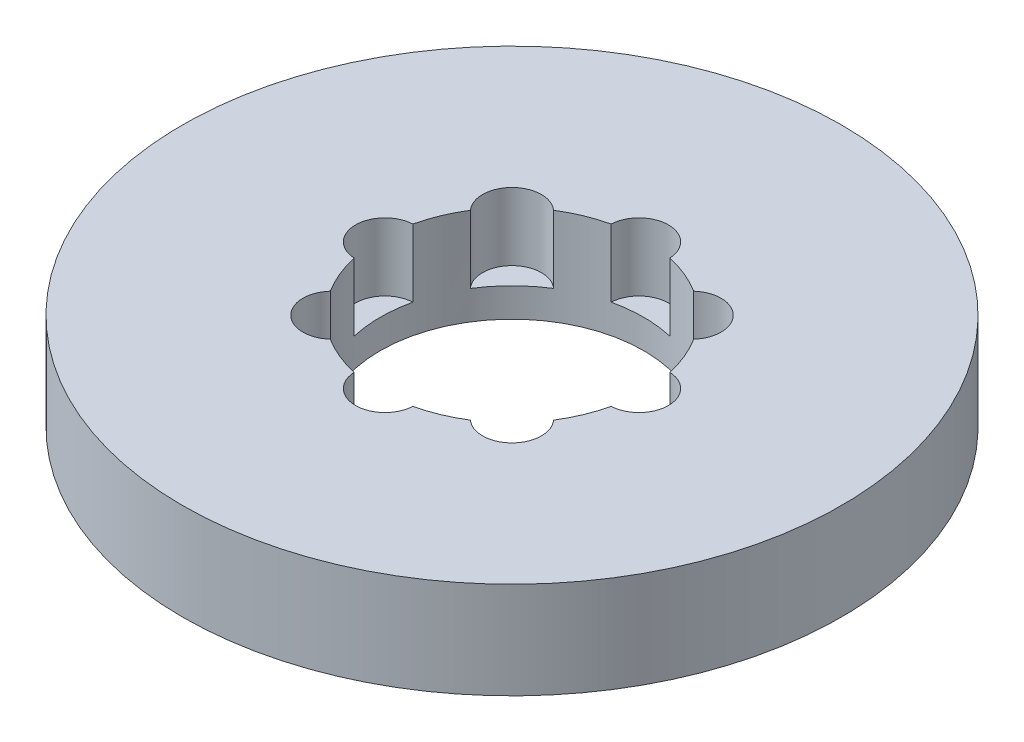
ISO-10303-21;
HEADER;
FILE_DESCRIPTION(('STEP AP214'),'2;1');
FILE_NAME('part.step','',(''),(''),'','','');
FILE_SCHEMA(('AUTOMOTIVE_DESIGN { 1 0 10303 214 1 1 1 1 }'));
ENDSEC;
DATA;
#1=APPLICATION_CONTEXT('core data for automotive mechanical design processes');
#2=APPLICATION_PROTOCOL_DEFINITION('international standard','automotive_design',2000,#1);
#3=PRODUCT_CONTEXT('',#1,'mechanical');
#4=PRODUCT('Part','Part','',(#3));
#5=PRODUCT_RELATED_PRODUCT_CATEGORY('part','',(#4));
#6=PRODUCT_DEFINITION_FORMATION('','',#4);
#7=PRODUCT_DEFINITION_CONTEXT('part definition',#1,'design');
#8=PRODUCT_DEFINITION('design','',#6,#7);
#9=PRODUCT_DEFINITION_SHAPE('','',#8);
#10=(LENGTH_UNIT() NAMED_UNIT(*) SI_UNIT(.MILLI.,.METRE.));
#11=(NAMED_UNIT(*) PLANE_ANGLE_UNIT() SI_UNIT($,.RADIAN.));
#12=(NAMED_UNIT(*) SI_UNIT($,.STERADIAN.) SOLID_ANGLE_UNIT());
#13=UNCERTAINTY_MEASURE_WITH_UNIT(LENGTH_MEASURE(1.E-05),#10,'distance_accuracy_value','');
#14=(GEOMETRIC_REPRESENTATION_CONTEXT(3) GLOBAL_UNCERTAINTY_ASSIGNED_CONTEXT((#13)) GLOBAL_UNIT_ASSIGNED_CONTEXT((#10,
#11,#12)) REPRESENTATION_CONTEXT('',''));
#15=CARTESIAN_POINT('',(0.,0.,0.));
#16=DIRECTION('',(0.,0.,1.));
#17=DIRECTION('',(1.,0.,0.));
#18=AXIS2_PLACEMENT_3D('',#15,#16,#17);
#19=CARTESIAN_POINT('',(0.,11.,0.));
#20=DIRECTION('',(0.,-1.,0.));
#21=DIRECTION('',(0.,0.,-1.));
#22=AXIS2_PLACEMENT_3D('',#19,#20,#21);
#23=CYLINDRICAL_SURFACE('',#22,37.5);
#24=CARTESIAN_POINT('',(0.,11.,0.));
#25=DIRECTION('',(0.,1.,0.));
#26=DIRECTION('',(0.,0.,1.));
#27=AXIS2_PLACEMENT_3D('',#24,#25,#26);
#28=CIRCLE('',#27,37.5);
#29=CARTESIAN_POINT('',(0.,11.,37.5));
#30=VERTEX_POINT('',#29);
#31=EDGE_CURVE('E183',#30,#30,#28,.T.);
#32=ORIENTED_EDGE('',*,*,#31,.F.);
#33=EDGE_LOOP('',(#32));
#34=FACE_BOUND('',#33,.T.);
#35=CARTESIAN_POINT('',(0.,0.,0.));
#36=DIRECTION('',(0.,1.,0.));
#37=DIRECTION('',(0.,0.,1.));
#38=AXIS2_PLACEMENT_3D('',#35,#36,#37);
#39=CIRCLE('',#38,37.5);
#40=CARTESIAN_POINT('',(0.,0.,37.5));
#41=VERTEX_POINT('',#40);
#42=EDGE_CURVE('E182',#41,#41,#39,.T.);
#43=ORIENTED_EDGE('',*,*,#42,.T.);
#44=EDGE_LOOP('',(#43));
#45=FACE_BOUND('',#44,.T.);
#46=ADVANCED_FACE('F39',(#34,#45),#23,.T.);
#47=CARTESIAN_POINT('',(0.,11.,0.));
#48=DIRECTION('',(0.,1.,0.));
#49=DIRECTION('',(0.,0.,1.));
#50=AXIS2_PLACEMENT_3D('',#47,#48,#49);
#51=PLANE('',#50);
#52=CARTESIAN_POINT('',(0.,11.,14.4545769503984));
#53=DIRECTION('',(0.,1.,0.));
#54=DIRECTION('',(1.,0.,0.));
#55=AXIS2_PLACEMENT_3D('',#52,#53,#54);
#56=CIRCLE('',#55,3.34973262926562);
#57=CARTESIAN_POINT('',(-3.34553834006836,11.,14.6221535081236));
#58=VERTEX_POINT('',#57);
#59=CARTESIAN_POINT('',(3.34553834006846,11.,14.6221535081236));
#60=VERTEX_POINT('',#59);
#61=EDGE_CURVE('E256',#58,#60,#56,.T.);
#62=ORIENTED_EDGE('',*,*,#61,.F.);
#63=CARTESIAN_POINT('',(0.,11.,0.));
#64=DIRECTION('',(0.,1.,0.));
#65=DIRECTION('',(0.,0.,1.));
#66=AXIS2_PLACEMENT_3D('',#63,#64,#65);
#67=CIRCLE('',#66,15.);
#68=CARTESIAN_POINT('',(-7.9737710541629,11.,12.7050767481269));
#69=VERTEX_POINT('',#68);
#70=EDGE_CURVE('E175',#69,#58,#67,.T.);
#71=ORIENTED_EDGE('',*,*,#70,.F.);
#72=CARTESIAN_POINT('',(-10.2209293808095,11.,10.2209293808095));
#73=DIRECTION('',(0.,1.,0.));
#74=DIRECTION('',(0.707106781186549,0.,0.707106781186546));
#75=AXIS2_PLACEMENT_3D('',#72,#73,#74);
#76=CIRCLE('',#75,3.34973262926562);
#77=CARTESIAN_POINT('',(-12.7050767481268,11.,7.97377105416295));
#78=VERTEX_POINT('',#77);
#79=EDGE_CURVE('E152',#78,#69,#76,.T.);
#80=ORIENTED_EDGE('',*,*,#79,.F.);
#81=CARTESIAN_POINT('',(-14.6221535081236,11.,3.34553834006841));
#82=VERTEX_POINT('',#81);
#83=EDGE_CURVE('E168',#82,#78,#67,.T.);
#84=ORIENTED_EDGE('',*,*,#83,.F.);
#85=CARTESIAN_POINT('',(-14.4545769503984,11.,0.));
#86=DIRECTION('',(0.,1.,0.));
#87=DIRECTION('',(0.,0.,1.));
#88=AXIS2_PLACEMENT_3D('',#85,#86,#87);
#89=CIRCLE('',#88,3.34973262926562);
#90=CARTESIAN_POINT('',(-14.6221535081236,11.,-3.34553834006841));
#91=VERTEX_POINT('',#90);
#92=EDGE_CURVE('E205',#91,#82,#89,.T.);
#93=ORIENTED_EDGE('',*,*,#92,.F.);
#94=CARTESIAN_POINT('',(-12.7050767481269,11.,-7.97377105416277));
#95=VERTEX_POINT('',#94);
#96=EDGE_CURVE('E181',#95,#91,#67,.T.);
#97=ORIENTED_EDGE('',*,*,#96,.F.);
#98=CARTESIAN_POINT('',(-10.2209293808096,11.,-10.2209293808094));
#99=DIRECTION('',(0.,1.,0.));
#100=DIRECTION('',(-0.707106781186539,0.,0.707106781186556));
#101=AXIS2_PLACEMENT_3D('',#98,#99,#100);
#102=CIRCLE('',#101,3.34973262926562);
#103=CARTESIAN_POINT('',(-7.97377105416308,11.,-12.7050767481267));
#104=VERTEX_POINT('',#103);
#105=EDGE_CURVE('E453',#104,#95,#102,.T.);
#106=ORIENTED_EDGE('',*,*,#105,.F.);
#107=CARTESIAN_POINT('',(-3.34553834006857,11.,-14.6221535081236));
#108=VERTEX_POINT('',#107);
#109=EDGE_CURVE('E189',#108,#104,#67,.T.);
#110=ORIENTED_EDGE('',*,*,#109,.F.);
#111=CARTESIAN_POINT('',(-1.51403657049564E-13,11.,-14.4545769503984));
#112=DIRECTION('',(0.,1.,0.));
#113=DIRECTION('',(-1.,0.,0.));
#114=AXIS2_PLACEMENT_3D('',#111,#112,#113);
#115=CIRCLE('',#114,3.34973262926562);
#116=CARTESIAN_POINT('',(3.34553834006826,11.,-14.6221535081237));
#117=VERTEX_POINT('',#116);
#118=EDGE_CURVE('E462',#117,#108,#115,.T.);
#119=ORIENTED_EDGE('',*,*,#118,.F.);
#120=CARTESIAN_POINT('',(7.97377105416282,11.,-12.7050767481269));
#121=VERTEX_POINT('',#120);
#122=EDGE_CURVE('E197',#121,#117,#67,.T.);
#123=ORIENTED_EDGE('',*,*,#122,.F.);
#124=CARTESIAN_POINT('',(10.2209293808094,11.,-10.2209293808096));
#125=DIRECTION('',(0.,1.,0.));
#126=DIRECTION('',(-0.707106781186554,0.,-0.707106781186541));
#127=AXIS2_PLACEMENT_3D('',#124,#125,#126);
#128=CIRCLE('',#127,3.34973262926562);
#129=CARTESIAN_POINT('',(12.7050767481268,11.,-7.97377105416304));
#130=VERTEX_POINT('',#129);
#131=EDGE_CURVE('E470',#130,#121,#128,.T.);
#132=ORIENTED_EDGE('',*,*,#131,.F.);
#133=CARTESIAN_POINT('',(14.6221535081236,11.,-3.34553834006841));
#134=VERTEX_POINT('',#133);
#135=EDGE_CURVE('E489',#134,#130,#67,.T.);
#136=ORIENTED_EDGE('',*,*,#135,.F.);
#137=CARTESIAN_POINT('',(14.4545769503984,11.,0.));
#138=DIRECTION('',(0.,1.,0.));
#139=DIRECTION('',(0.,0.,-1.));
#140=AXIS2_PLACEMENT_3D('',#137,#138,#139);
#141=CIRCLE('',#140,3.34973262926562);
#142=CARTESIAN_POINT('',(14.6221535081236,11.,3.34553834006841));
#143=VERTEX_POINT('',#142);
#144=EDGE_CURVE('E476',#143,#134,#141,.T.);
#145=ORIENTED_EDGE('',*,*,#144,.F.);
#146=CARTESIAN_POINT('',(12.7050767481269,11.,7.97377105416286));
#147=VERTEX_POINT('',#146);
#148=EDGE_CURVE('E491',#147,#143,#67,.T.);
#149=ORIENTED_EDGE('',*,*,#148,.F.);
#150=CARTESIAN_POINT('',(10.2209293808095,11.,10.2209293808094));
#151=DIRECTION('',(0.,1.,0.));
#152=DIRECTION('',(0.707106781186544,0.,-0.707106781186551));
#153=AXIS2_PLACEMENT_3D('',#150,#151,#152);
#154=CIRCLE('',#153,3.34973262926562);
#155=CARTESIAN_POINT('',(7.97377105416299,11.,12.7050767481268));
#156=VERTEX_POINT('',#155);
#157=EDGE_CURVE('E475',#156,#147,#154,.T.);
#158=ORIENTED_EDGE('',*,*,#157,.F.);
#159=EDGE_CURVE('E190',#60,#156,#67,.T.);
#160=ORIENTED_EDGE('',*,*,#159,.F.);
#161=EDGE_LOOP('',(#62,#71,#80,#84,#93,#97,#106,#110,#119,#123,#132,#136,#145,#149,#158,#160));
#162=FACE_BOUND('',#161,.T.);
#163=ORIENTED_EDGE('',*,*,#31,.T.);
#164=EDGE_LOOP('',(#163));
#165=FACE_BOUND('',#164,.T.);
#166=ADVANCED_FACE('F170',(#162,#165),#51,.T.);
#167=CARTESIAN_POINT('',(0.,0.,0.));
#168=DIRECTION('',(0.,1.,0.));
#169=DIRECTION('',(0.,0.,1.));
#170=AXIS2_PLACEMENT_3D('',#167,#168,#169);
#171=PLANE('',#170);
#172=CARTESIAN_POINT('',(0.,0.,0.));
#173=DIRECTION('',(0.,1.,0.));
#174=DIRECTION('',(0.,0.,1.));
#175=AXIS2_PLACEMENT_3D('',#172,#173,#174);
#176=CIRCLE('',#175,15.);
#177=CARTESIAN_POINT('',(0.,0.,15.));
#178=VERTEX_POINT('',#177);
#179=EDGE_CURVE('E191',#178,#178,#176,.T.);
#180=ORIENTED_EDGE('',*,*,#179,.T.);
#181=EDGE_LOOP('',(#180));
#182=FACE_BOUND('',#181,.T.);
#183=ORIENTED_EDGE('',*,*,#42,.F.);
#184=EDGE_LOOP('',(#183));
#185=FACE_BOUND('',#184,.T.);
#186=ADVANCED_FACE('F277',(#182,#185),#171,.F.);
#187=CARTESIAN_POINT('',(0.,11.,0.));
#188=DIRECTION('',(0.,-1.,0.));
#189=DIRECTION('',(0.,0.,-1.));
#190=AXIS2_PLACEMENT_3D('',#187,#188,#189);
#191=CYLINDRICAL_SURFACE('',#190,15.);
#192=DIRECTION('',(0.,1.,0.));
#193=VECTOR('',#192,1.);
#194=CARTESIAN_POINT('',(-3.34553834006836,7.14872177654088,14.6221535081236));
#195=LINE('',#194,#193);
#196=CARTESIAN_POINT('',(-3.34553834006836,3.29744355308177,14.6221535081236));
#197=VERTEX_POINT('',#196);
#198=EDGE_CURVE('E11',#197,#58,#195,.T.);
#199=ORIENTED_EDGE('',*,*,#198,.F.);
#200=CARTESIAN_POINT('',(0.,3.29744355308177,0.));
#201=DIRECTION('',(0.,1.,0.));
#202=DIRECTION('',(0.,0.,1.));
#203=AXIS2_PLACEMENT_3D('',#200,#201,#202);
#204=CIRCLE('',#203,15.);
#205=CARTESIAN_POINT('',(3.34553834006846,3.29744355308177,14.6221535081236));
#206=VERTEX_POINT('',#205);
#207=EDGE_CURVE('E251',#197,#206,#204,.T.);
#208=ORIENTED_EDGE('',*,*,#207,.T.);
#209=DIRECTION('',(0.,1.,0.));
#210=VECTOR('',#209,1.);
#211=CARTESIAN_POINT('',(3.34553834006846,7.14872177654088,14.6221535081236));
#212=LINE('',#211,#210);
#213=EDGE_CURVE('E46',#60,#206,#212,.F.);
#214=ORIENTED_EDGE('',*,*,#213,.F.);
#215=ORIENTED_EDGE('',*,*,#159,.T.);
#216=DIRECTION('',(0.,1.,0.));
#217=VECTOR('',#216,1.);
#218=CARTESIAN_POINT('',(7.97377105416299,7.14872177654088,12.7050767481268));
#219=LINE('',#218,#217);
#220=CARTESIAN_POINT('',(7.97377105416299,3.29744355308177,12.7050767481268));
#221=VERTEX_POINT('',#220);
#222=EDGE_CURVE('E253',#221,#156,#219,.T.);
#223=ORIENTED_EDGE('',*,*,#222,.F.);
#224=CARTESIAN_POINT('',(0.,3.29744355308177,0.));
#225=DIRECTION('',(0.,1.,0.));
#226=DIRECTION('',(0.,0.,1.));
#227=AXIS2_PLACEMENT_3D('',#224,#225,#226);
#228=CIRCLE('',#227,15.);
#229=CARTESIAN_POINT('',(12.7050767481269,3.29744355308177,7.97377105416286));
#230=VERTEX_POINT('',#229);
#231=EDGE_CURVE('E246',#221,#230,#228,.T.);
#232=ORIENTED_EDGE('',*,*,#231,.T.);
#233=DIRECTION('',(0.,1.,0.));
#234=VECTOR('',#233,1.);
#235=CARTESIAN_POINT('',(12.7050767481269,7.14872177654088,7.97377105416286));
#236=LINE('',#235,#234);
#237=EDGE_CURVE('E248',#147,#230,#236,.F.);
#238=ORIENTED_EDGE('',*,*,#237,.F.);
#239=ORIENTED_EDGE('',*,*,#148,.T.);
#240=DIRECTION('',(0.,1.,0.));
#241=VECTOR('',#240,1.);
#242=CARTESIAN_POINT('',(14.6221535081236,7.14872177654088,3.34553834006841));
#243=LINE('',#242,#241);
#244=CARTESIAN_POINT('',(14.6221535081236,3.29744355308177,3.34553834006841));
#245=VERTEX_POINT('',#244);
#246=EDGE_CURVE('E243',#245,#143,#243,.T.);
#247=ORIENTED_EDGE('',*,*,#246,.F.);
#248=CARTESIAN_POINT('',(0.,3.29744355308177,0.));
#249=DIRECTION('',(0.,1.,0.));
#250=DIRECTION('',(0.,0.,1.));
#251=AXIS2_PLACEMENT_3D('',#248,#249,#250);
#252=CIRCLE('',#251,15.);
#253=CARTESIAN_POINT('',(14.6221535081236,3.29744355308177,-3.34553834006841));
#254=VERTEX_POINT('',#253);
#255=EDGE_CURVE('E236',#245,#254,#252,.T.);
#256=ORIENTED_EDGE('',*,*,#255,.T.);
#257=DIRECTION('',(0.,1.,0.));
#258=VECTOR('',#257,1.);
#259=CARTESIAN_POINT('',(14.6221535081236,7.14872177654088,-3.34553834006841));
#260=LINE('',#259,#258);
#261=EDGE_CURVE('E241',#134,#254,#260,.F.);
#262=ORIENTED_EDGE('',*,*,#261,.F.);
#263=ORIENTED_EDGE('',*,*,#135,.T.);
#264=DIRECTION('',(0.,1.,0.));
#265=VECTOR('',#264,1.);
#266=CARTESIAN_POINT('',(12.7050767481268,7.14872177654088,-7.97377105416304));
#267=LINE('',#266,#265);
#268=CARTESIAN_POINT('',(12.7050767481268,3.29744355308177,-7.97377105416304));
#269=VERTEX_POINT('',#268);
#270=EDGE_CURVE('E237',#269,#130,#267,.T.);
#271=ORIENTED_EDGE('',*,*,#270,.F.);
#272=CARTESIAN_POINT('',(0.,3.29744355308177,0.));
#273=DIRECTION('',(0.,1.,0.));
#274=DIRECTION('',(0.,0.,1.));
#275=AXIS2_PLACEMENT_3D('',#272,#273,#274);
#276=CIRCLE('',#275,15.);
#277=CARTESIAN_POINT('',(7.97377105416282,3.29744355308177,-12.7050767481269));
#278=VERTEX_POINT('',#277);
#279=EDGE_CURVE('E229',#269,#278,#276,.T.);
#280=ORIENTED_EDGE('',*,*,#279,.T.);
#281=DIRECTION('',(0.,1.,0.));
#282=VECTOR('',#281,1.);
#283=CARTESIAN_POINT('',(7.97377105416281,7.14872177654088,-12.7050767481269));
#284=LINE('',#283,#282);
#285=EDGE_CURVE('E232',#121,#278,#284,.F.);
#286=ORIENTED_EDGE('',*,*,#285,.F.);
#287=ORIENTED_EDGE('',*,*,#122,.T.);
#288=DIRECTION('',(0.,1.,0.));
#289=VECTOR('',#288,1.);
#290=CARTESIAN_POINT('',(3.34553834006826,7.14872177654088,-14.6221535081237));
#291=LINE('',#290,#289);
#292=CARTESIAN_POINT('',(3.34553834006826,3.29744355308177,-14.6221535081237));
#293=VERTEX_POINT('',#292);
#294=EDGE_CURVE('E227',#293,#117,#291,.T.);
#295=ORIENTED_EDGE('',*,*,#294,.F.);
#296=CARTESIAN_POINT('',(0.,3.29744355308177,0.));
#297=DIRECTION('',(0.,1.,0.));
#298=DIRECTION('',(0.,0.,1.));
#299=AXIS2_PLACEMENT_3D('',#296,#297,#298);
#300=CIRCLE('',#299,15.);
#301=CARTESIAN_POINT('',(-3.34553834006857,3.29744355308177,-14.6221535081236));
#302=VERTEX_POINT('',#301);
#303=EDGE_CURVE('E225',#293,#302,#300,.T.);
#304=ORIENTED_EDGE('',*,*,#303,.T.);
#305=DIRECTION('',(0.,1.,0.));
#306=VECTOR('',#305,1.);
#307=CARTESIAN_POINT('',(-3.34553834006857,7.14872177654088,-14.6221535081236));
#308=LINE('',#307,#306);
#309=EDGE_CURVE('E223',#108,#302,#308,.F.);
#310=ORIENTED_EDGE('',*,*,#309,.F.);
#311=ORIENTED_EDGE('',*,*,#109,.T.);
#312=DIRECTION('',(0.,1.,0.));
#313=VECTOR('',#312,1.);
#314=CARTESIAN_POINT('',(-7.97377105416308,7.14872177654088,-12.7050767481267));
#315=LINE('',#314,#313);
#316=CARTESIAN_POINT('',(-7.97377105416308,3.29744355308177,-12.7050767481267));
#317=VERTEX_POINT('',#316);
#318=EDGE_CURVE('E219',#317,#104,#315,.T.);
#319=ORIENTED_EDGE('',*,*,#318,.F.);
#320=CARTESIAN_POINT('',(0.,3.29744355308177,0.));
#321=DIRECTION('',(0.,1.,0.));
#322=DIRECTION('',(0.,0.,1.));
#323=AXIS2_PLACEMENT_3D('',#320,#321,#322);
#324=CIRCLE('',#323,15.);
#325=CARTESIAN_POINT('',(-12.7050767481269,3.29744355308177,-7.97377105416277));
#326=VERTEX_POINT('',#325);
#327=EDGE_CURVE('E159',#317,#326,#324,.T.);
#328=ORIENTED_EDGE('',*,*,#327,.T.);
#329=DIRECTION('',(0.,1.,0.));
#330=VECTOR('',#329,1.);
#331=CARTESIAN_POINT('',(-12.7050767481269,7.14872177654088,-7.97377105416277));
#332=LINE('',#331,#330);
#333=EDGE_CURVE('E220',#95,#326,#332,.F.);
#334=ORIENTED_EDGE('',*,*,#333,.F.);
#335=ORIENTED_EDGE('',*,*,#96,.T.);
#336=DIRECTION('',(0.,1.,0.));
#337=VECTOR('',#336,1.);
#338=CARTESIAN_POINT('',(-14.6221535081236,7.14872177654088,-3.34553834006841));
#339=LINE('',#338,#337);
#340=CARTESIAN_POINT('',(-14.6221535081236,3.29744355308177,-3.34553834006841));
#341=VERTEX_POINT('',#340);
#342=EDGE_CURVE('E209',#341,#91,#339,.T.);
#343=ORIENTED_EDGE('',*,*,#342,.F.);
#344=CARTESIAN_POINT('',(0.,3.29744355308177,0.));
#345=DIRECTION('',(0.,1.,0.));
#346=DIRECTION('',(0.,0.,1.));
#347=AXIS2_PLACEMENT_3D('',#344,#345,#346);
#348=CIRCLE('',#347,15.);
#349=CARTESIAN_POINT('',(-14.6221535081236,3.29744355308177,3.34553834006841));
#350=VERTEX_POINT('',#349);
#351=EDGE_CURVE('E206',#341,#350,#348,.T.);
#352=ORIENTED_EDGE('',*,*,#351,.T.);
#353=DIRECTION('',(0.,1.,0.));
#354=VECTOR('',#353,1.);
#355=CARTESIAN_POINT('',(-14.6221535081236,7.14872177654088,3.34553834006841));
#356=LINE('',#355,#354);
#357=EDGE_CURVE('E179',#82,#350,#356,.F.);
#358=ORIENTED_EDGE('',*,*,#357,.F.);
#359=ORIENTED_EDGE('',*,*,#83,.T.);
#360=DIRECTION('',(0.,1.,0.));
#361=VECTOR('',#360,1.);
#362=CARTESIAN_POINT('',(-12.7050767481268,7.14872177654088,7.97377105416295));
#363=LINE('',#362,#361);
#364=CARTESIAN_POINT('',(-12.7050767481268,3.29744355308177,7.97377105416295));
#365=VERTEX_POINT('',#364);
#366=EDGE_CURVE('E147',#365,#78,#363,.T.);
#367=ORIENTED_EDGE('',*,*,#366,.F.);
#368=CARTESIAN_POINT('',(0.,3.29744355308177,0.));
#369=DIRECTION('',(0.,1.,0.));
#370=DIRECTION('',(0.,0.,1.));
#371=AXIS2_PLACEMENT_3D('',#368,#369,#370);
#372=CIRCLE('',#371,15.);
#373=CARTESIAN_POINT('',(-7.9737710541629,3.29744355308177,12.7050767481269));
#374=VERTEX_POINT('',#373);
#375=EDGE_CURVE('E215',#365,#374,#372,.T.);
#376=ORIENTED_EDGE('',*,*,#375,.T.);
#377=DIRECTION('',(0.,1.,0.));
#378=VECTOR('',#377,1.);
#379=CARTESIAN_POINT('',(-7.9737710541629,7.14872177654088,12.7050767481269));
#380=LINE('',#379,#378);
#381=EDGE_CURVE('E161',#69,#374,#380,.F.);
#382=ORIENTED_EDGE('',*,*,#381,.F.);
#383=ORIENTED_EDGE('',*,*,#70,.T.);
#384=EDGE_LOOP('',(#199,#208,#214,#215,#223,#232,#238,#239,#247,#256,#262,#263,#271,#280,#286,
#287,#295,#304,#310,#311,#319,#328,#334,#335,#343,#352,#358,#359,#367,#376,#382,#383));
#385=FACE_BOUND('',#384,.T.);
#386=ORIENTED_EDGE('',*,*,#179,.F.);
#387=EDGE_LOOP('',(#386));
#388=FACE_BOUND('',#387,.T.);
#389=ADVANCED_FACE('F176',(#385,#388),#191,.F.);
#390=CARTESIAN_POINT('',(-14.4545769503984,3.29744355308177,0.));
#391=DIRECTION('',(0.,1.,0.));
#392=DIRECTION('',(0.,0.,1.));
#393=AXIS2_PLACEMENT_3D('',#390,#391,#392);
#394=CYLINDRICAL_SURFACE('',#393,3.34973262926562);
#395=ORIENTED_EDGE('',*,*,#342,.T.);
#396=ORIENTED_EDGE('',*,*,#92,.T.);
#397=ORIENTED_EDGE('',*,*,#357,.T.);
#398=CARTESIAN_POINT('',(-14.4545769503984,3.29744355308177,0.));
#399=DIRECTION('',(0.,1.,0.));
#400=DIRECTION('',(0.,0.,1.));
#401=AXIS2_PLACEMENT_3D('',#398,#399,#400);
#402=CIRCLE('',#401,3.34973262926562);
#403=EDGE_CURVE('E200',#341,#350,#402,.T.);
#404=ORIENTED_EDGE('',*,*,#403,.F.);
#405=EDGE_LOOP('',(#395,#396,#397,#404));
#406=FACE_BOUND('',#405,.T.);
#407=ADVANCED_FACE('F286',(#406),#394,.F.);
#408=CARTESIAN_POINT('',(-14.4545769503984,3.29744355308177,0.));
#409=DIRECTION('',(0.,1.,0.));
#410=DIRECTION('',(0.,0.,1.));
#411=AXIS2_PLACEMENT_3D('',#408,#409,#410);
#412=PLANE('',#411);
#413=ORIENTED_EDGE('',*,*,#403,.T.);
#414=ORIENTED_EDGE('',*,*,#351,.F.);
#415=EDGE_LOOP('',(#413,#414));
#416=FACE_BOUND('',#415,.T.);
#417=ADVANCED_FACE('F289',(#416),#412,.T.);
#418=CARTESIAN_POINT('',(-10.2209293808095,3.29744355308177,10.2209293808095));
#419=DIRECTION('',(0.,1.,0.));
#420=DIRECTION('',(0.,0.,1.));
#421=AXIS2_PLACEMENT_3D('',#418,#419,#420);
#422=CYLINDRICAL_SURFACE('',#421,3.34973262926562);
#423=ORIENTED_EDGE('',*,*,#366,.T.);
#424=ORIENTED_EDGE('',*,*,#79,.T.);
#425=ORIENTED_EDGE('',*,*,#381,.T.);
#426=CARTESIAN_POINT('',(-10.2209293808095,3.29744355308177,10.2209293808095));
#427=DIRECTION('',(0.,1.,0.));
#428=DIRECTION('',(0.707106781186549,0.,0.707106781186546));
#429=AXIS2_PLACEMENT_3D('',#426,#427,#428);
#430=CIRCLE('',#429,3.34973262926562);
#431=EDGE_CURVE('E156',#365,#374,#430,.T.);
#432=ORIENTED_EDGE('',*,*,#431,.F.);
#433=EDGE_LOOP('',(#423,#424,#425,#432));
#434=FACE_BOUND('',#433,.T.);
#435=ADVANCED_FACE('F155',(#434),#422,.F.);
#436=CARTESIAN_POINT('',(-10.2209293808095,3.29744355308177,10.2209293808095));
#437=DIRECTION('',(0.,1.,0.));
#438=DIRECTION('',(0.707106781186549,0.,0.707106781186546));
#439=AXIS2_PLACEMENT_3D('',#436,#437,#438);
#440=PLANE('',#439);
#441=ORIENTED_EDGE('',*,*,#431,.T.);
#442=ORIENTED_EDGE('',*,*,#375,.F.);
#443=EDGE_LOOP('',(#441,#442));
#444=FACE_BOUND('',#443,.T.);
#445=ADVANCED_FACE('F300',(#444),#440,.T.);
#446=CARTESIAN_POINT('',(-10.2209293808096,3.29744355308177,-10.2209293808094));
#447=DIRECTION('',(0.,1.,0.));
#448=DIRECTION('',(0.,0.,1.));
#449=AXIS2_PLACEMENT_3D('',#446,#447,#448);
#450=CYLINDRICAL_SURFACE('',#449,3.34973262926562);
#451=ORIENTED_EDGE('',*,*,#318,.T.);
#452=ORIENTED_EDGE('',*,*,#105,.T.);
#453=ORIENTED_EDGE('',*,*,#333,.T.);
#454=CARTESIAN_POINT('',(-10.2209293808096,3.29744355308177,-10.2209293808094));
#455=DIRECTION('',(0.,1.,0.));
#456=DIRECTION('',(-0.707106781186539,0.,0.707106781186556));
#457=AXIS2_PLACEMENT_3D('',#454,#455,#456);
#458=CIRCLE('',#457,3.34973262926562);
#459=EDGE_CURVE('E454',#317,#326,#458,.T.);
#460=ORIENTED_EDGE('',*,*,#459,.F.);
#461=EDGE_LOOP('',(#451,#452,#453,#460));
#462=FACE_BOUND('',#461,.T.);
#463=ADVANCED_FACE('F299',(#462),#450,.F.);
#464=CARTESIAN_POINT('',(-10.2209293808096,3.29744355308177,-10.2209293808094));
#465=DIRECTION('',(0.,1.,0.));
#466=DIRECTION('',(-0.707106781186539,0.,0.707106781186556));
#467=AXIS2_PLACEMENT_3D('',#464,#465,#466);
#468=PLANE('',#467);
#469=ORIENTED_EDGE('',*,*,#459,.T.);
#470=ORIENTED_EDGE('',*,*,#327,.F.);
#471=EDGE_LOOP('',(#469,#470));
#472=FACE_BOUND('',#471,.T.);
#473=ADVANCED_FACE('F379',(#472),#468,.T.);
#474=CARTESIAN_POINT('',(-1.51403657049564E-13,3.29744355308177,-14.4545769503984));
#475=DIRECTION('',(0.,1.,0.));
#476=DIRECTION('',(0.,0.,1.));
#477=AXIS2_PLACEMENT_3D('',#474,#475,#476);
#478=CYLINDRICAL_SURFACE('',#477,3.34973262926562);
#479=ORIENTED_EDGE('',*,*,#294,.T.);
#480=ORIENTED_EDGE('',*,*,#118,.T.);
#481=ORIENTED_EDGE('',*,*,#309,.T.);
#482=CARTESIAN_POINT('',(-1.51403657049564E-13,3.29744355308177,-14.4545769503984));
#483=DIRECTION('',(0.,1.,0.));
#484=DIRECTION('',(-1.,0.,0.));
#485=AXIS2_PLACEMENT_3D('',#482,#483,#484);
#486=CIRCLE('',#485,3.34973262926562);
#487=EDGE_CURVE('E465',#293,#302,#486,.T.);
#488=ORIENTED_EDGE('',*,*,#487,.F.);
#489=EDGE_LOOP('',(#479,#480,#481,#488));
#490=FACE_BOUND('',#489,.T.);
#491=ADVANCED_FACE('F371',(#490),#478,.F.);
#492=CARTESIAN_POINT('',(-1.51403657049564E-13,3.29744355308177,-14.4545769503984));
#493=DIRECTION('',(0.,1.,0.));
#494=DIRECTION('',(-1.,0.,0.));
#495=AXIS2_PLACEMENT_3D('',#492,#493,#494);
#496=PLANE('',#495);
#497=ORIENTED_EDGE('',*,*,#487,.T.);
#498=ORIENTED_EDGE('',*,*,#303,.F.);
#499=EDGE_LOOP('',(#497,#498));
#500=FACE_BOUND('',#499,.T.);
#501=ADVANCED_FACE('F308',(#500),#496,.T.);
#502=CARTESIAN_POINT('',(10.2209293808094,3.29744355308177,-10.2209293808096));
#503=DIRECTION('',(0.,1.,0.));
#504=DIRECTION('',(0.,0.,1.));
#505=AXIS2_PLACEMENT_3D('',#502,#503,#504);
#506=CYLINDRICAL_SURFACE('',#505,3.34973262926562);
#507=ORIENTED_EDGE('',*,*,#270,.T.);
#508=ORIENTED_EDGE('',*,*,#131,.T.);
#509=ORIENTED_EDGE('',*,*,#285,.T.);
#510=CARTESIAN_POINT('',(10.2209293808094,3.29744355308177,-10.2209293808096));
#511=DIRECTION('',(0.,1.,0.));
#512=DIRECTION('',(-0.707106781186554,0.,-0.707106781186541));
#513=AXIS2_PLACEMENT_3D('',#510,#511,#512);
#514=CIRCLE('',#513,3.34973262926562);
#515=EDGE_CURVE('E477',#269,#278,#514,.T.);
#516=ORIENTED_EDGE('',*,*,#515,.F.);
#517=EDGE_LOOP('',(#507,#508,#509,#516));
#518=FACE_BOUND('',#517,.T.);
#519=ADVANCED_FACE('F305',(#518),#506,.F.);
#520=CARTESIAN_POINT('',(10.2209293808094,3.29744355308177,-10.2209293808096));
#521=DIRECTION('',(0.,1.,0.));
#522=DIRECTION('',(-0.707106781186554,0.,-0.707106781186541));
#523=AXIS2_PLACEMENT_3D('',#520,#521,#522);
#524=PLANE('',#523);
#525=ORIENTED_EDGE('',*,*,#515,.T.);
#526=ORIENTED_EDGE('',*,*,#279,.F.);
#527=EDGE_LOOP('',(#525,#526));
#528=FACE_BOUND('',#527,.T.);
#529=ADVANCED_FACE('F304',(#528),#524,.T.);
#530=CARTESIAN_POINT('',(14.4545769503984,3.29744355308177,0.));
#531=DIRECTION('',(0.,1.,0.));
#532=DIRECTION('',(0.,0.,1.));
#533=AXIS2_PLACEMENT_3D('',#530,#531,#532);
#534=CYLINDRICAL_SURFACE('',#533,3.34973262926562);
#535=ORIENTED_EDGE('',*,*,#246,.T.);
#536=ORIENTED_EDGE('',*,*,#144,.T.);
#537=ORIENTED_EDGE('',*,*,#261,.T.);
#538=CARTESIAN_POINT('',(14.4545769503984,3.29744355308177,0.));
#539=DIRECTION('',(0.,1.,0.));
#540=DIRECTION('',(0.,0.,-1.));
#541=AXIS2_PLACEMENT_3D('',#538,#539,#540);
#542=CIRCLE('',#541,3.34973262926562);
#543=EDGE_CURVE('E478',#245,#254,#542,.T.);
#544=ORIENTED_EDGE('',*,*,#543,.F.);
#545=EDGE_LOOP('',(#535,#536,#537,#544));
#546=FACE_BOUND('',#545,.T.);
#547=ADVANCED_FACE('F309',(#546),#534,.F.);
#548=CARTESIAN_POINT('',(14.4545769503984,3.29744355308177,0.));
#549=DIRECTION('',(0.,1.,0.));
#550=DIRECTION('',(0.,0.,-1.));
#551=AXIS2_PLACEMENT_3D('',#548,#549,#550);
#552=PLANE('',#551);
#553=ORIENTED_EDGE('',*,*,#543,.T.);
#554=ORIENTED_EDGE('',*,*,#255,.F.);
#555=EDGE_LOOP('',(#553,#554));
#556=FACE_BOUND('',#555,.T.);
#557=ADVANCED_FACE('F314',(#556),#552,.T.);
#558=CARTESIAN_POINT('',(10.2209293808095,3.29744355308177,10.2209293808094));
#559=DIRECTION('',(0.,1.,0.));
#560=DIRECTION('',(0.,0.,1.));
#561=AXIS2_PLACEMENT_3D('',#558,#559,#560);
#562=CYLINDRICAL_SURFACE('',#561,3.34973262926562);
#563=ORIENTED_EDGE('',*,*,#222,.T.);
#564=ORIENTED_EDGE('',*,*,#157,.T.);
#565=ORIENTED_EDGE('',*,*,#237,.T.);
#566=CARTESIAN_POINT('',(10.2209293808095,3.29744355308177,10.2209293808094));
#567=DIRECTION('',(0.,1.,0.));
#568=DIRECTION('',(0.707106781186544,0.,-0.707106781186551));
#569=AXIS2_PLACEMENT_3D('',#566,#567,#568);
#570=CIRCLE('',#569,3.34973262926562);
#571=EDGE_CURVE('E56',#221,#230,#570,.T.);
#572=ORIENTED_EDGE('',*,*,#571,.F.);
#573=EDGE_LOOP('',(#563,#564,#565,#572));
#574=FACE_BOUND('',#573,.T.);
#575=ADVANCED_FACE('F318',(#574),#562,.F.);
#576=CARTESIAN_POINT('',(10.2209293808095,3.29744355308177,10.2209293808094));
#577=DIRECTION('',(0.,1.,0.));
#578=DIRECTION('',(0.707106781186544,0.,-0.707106781186551));
#579=AXIS2_PLACEMENT_3D('',#576,#577,#578);
#580=PLANE('',#579);
#581=ORIENTED_EDGE('',*,*,#571,.T.);
#582=ORIENTED_EDGE('',*,*,#231,.F.);
#583=EDGE_LOOP('',(#581,#582));
#584=FACE_BOUND('',#583,.T.);
#585=ADVANCED_FACE('F270',(#584),#580,.T.);
#586=CARTESIAN_POINT('',(0.,3.29744355308177,14.4545769503984));
#587=DIRECTION('',(0.,1.,0.));
#588=DIRECTION('',(0.,0.,1.));
#589=AXIS2_PLACEMENT_3D('',#586,#587,#588);
#590=CYLINDRICAL_SURFACE('',#589,3.34973262926562);
#591=ORIENTED_EDGE('',*,*,#198,.T.);
#592=ORIENTED_EDGE('',*,*,#61,.T.);
#593=ORIENTED_EDGE('',*,*,#213,.T.);
#594=CARTESIAN_POINT('',(0.,3.29744355308177,14.4545769503984));
#595=DIRECTION('',(0.,1.,0.));
#596=DIRECTION('',(1.,0.,0.));
#597=AXIS2_PLACEMENT_3D('',#594,#595,#596);
#598=CIRCLE('',#597,3.34973262926562);
#599=EDGE_CURVE('E55',#197,#206,#598,.T.);
#600=ORIENTED_EDGE('',*,*,#599,.F.);
#601=EDGE_LOOP('',(#591,#592,#593,#600));
#602=FACE_BOUND('',#601,.T.);
#603=ADVANCED_FACE('F260',(#602),#590,.F.);
#604=CARTESIAN_POINT('',(0.,3.29744355308177,14.4545769503984));
#605=DIRECTION('',(0.,1.,0.));
#606=DIRECTION('',(1.,0.,0.));
#607=AXIS2_PLACEMENT_3D('',#604,#605,#606);
#608=PLANE('',#607);
#609=ORIENTED_EDGE('',*,*,#599,.T.);
#610=ORIENTED_EDGE('',*,*,#207,.F.);
#611=EDGE_LOOP('',(#609,#610));
#612=FACE_BOUND('',#611,.T.);
#613=ADVANCED_FACE('F261',(#612),#608,.T.);
#614=CLOSED_SHELL('',(#46,#166,#186,#389,#407,#417,#435,#445,#463,#473,#491,#501,#519,#529,#547,
#557,#575,#585,#603,#613));
#615=MANIFOLD_SOLID_BREP('B2',#614);
#616=ADVANCED_BREP_SHAPE_REPRESENTATION('',(#18,#615),#14);
#617=SHAPE_DEFINITION_REPRESENTATION(#9,#616);
ENDSEC;
END-ISO-10303-21;
